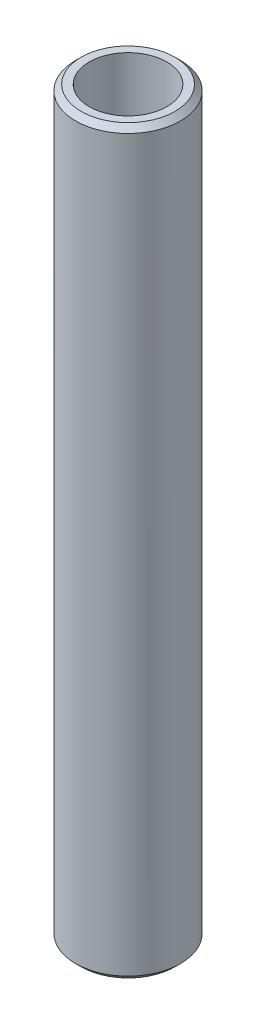
ISO-10303-21;
HEADER;
FILE_DESCRIPTION(('STEP AP214'),'2;1');
FILE_NAME('part.step','',(''),(''),'','','');
FILE_SCHEMA(('AUTOMOTIVE_DESIGN { 1 0 10303 214 1 1 1 1 }'));
ENDSEC;
DATA;
#1=APPLICATION_CONTEXT('core data for automotive mechanical design processes');
#2=APPLICATION_PROTOCOL_DEFINITION('international standard','automotive_design',2000,#1);
#3=PRODUCT_CONTEXT('',#1,'mechanical');
#4=PRODUCT('Part','Part','',(#3));
#5=PRODUCT_RELATED_PRODUCT_CATEGORY('part','',(#4));
#6=PRODUCT_DEFINITION_FORMATION('','',#4);
#7=PRODUCT_DEFINITION_CONTEXT('part definition',#1,'design');
#8=PRODUCT_DEFINITION('design','',#6,#7);
#9=PRODUCT_DEFINITION_SHAPE('','',#8);
#10=(LENGTH_UNIT() NAMED_UNIT(*) SI_UNIT(.MILLI.,.METRE.));
#11=(NAMED_UNIT(*) PLANE_ANGLE_UNIT() SI_UNIT($,.RADIAN.));
#12=(NAMED_UNIT(*) SI_UNIT($,.STERADIAN.) SOLID_ANGLE_UNIT());
#13=UNCERTAINTY_MEASURE_WITH_UNIT(LENGTH_MEASURE(1.E-05),#10,'distance_accuracy_value','');
#14=(GEOMETRIC_REPRESENTATION_CONTEXT(3) GLOBAL_UNCERTAINTY_ASSIGNED_CONTEXT((#13)) GLOBAL_UNIT_ASSIGNED_CONTEXT((#10,
#11,#12)) REPRESENTATION_CONTEXT('',''));
#15=CARTESIAN_POINT('',(0.,0.,0.));
#16=DIRECTION('',(0.,0.,1.));
#17=DIRECTION('',(1.,0.,0.));
#18=AXIS2_PLACEMENT_3D('',#15,#16,#17);
#19=CARTESIAN_POINT('',(0.,600.,0.));
#20=DIRECTION('',(0.,-1.,0.));
#21=DIRECTION('',(0.,0.,-1.));
#22=AXIS2_PLACEMENT_3D('',#19,#20,#21);
#23=CYLINDRICAL_SURFACE('',#22,42.5);
#24=CARTESIAN_POINT('',(0.,595.531423613547,0.));
#25=DIRECTION('',(0.,1.,0.));
#26=DIRECTION('',(0.,0.,1.));
#27=AXIS2_PLACEMENT_3D('',#24,#25,#26);
#28=CIRCLE('',#27,42.5);
#29=CARTESIAN_POINT('',(0.,595.531423613547,-42.5000000000001));
#30=VERTEX_POINT('',#29);
#31=EDGE_CURVE('E50',#30,#30,#28,.F.);
#32=ORIENTED_EDGE('',*,*,#31,.T.);
#33=EDGE_LOOP('',(#32));
#34=FACE_BOUND('',#33,.T.);
#35=CARTESIAN_POINT('',(0.,4.46857638645315,0.));
#36=DIRECTION('',(0.,1.,0.));
#37=DIRECTION('',(0.,0.,1.));
#38=AXIS2_PLACEMENT_3D('',#35,#36,#37);
#39=CIRCLE('',#38,42.5);
#40=CARTESIAN_POINT('',(0.,4.46857638645315,42.5));
#41=VERTEX_POINT('',#40);
#42=EDGE_CURVE('E51',#41,#41,#39,.T.);
#43=ORIENTED_EDGE('',*,*,#42,.T.);
#44=EDGE_LOOP('',(#43));
#45=FACE_BOUND('',#44,.T.);
#46=ADVANCED_FACE('F39',(#34,#45),#23,.T.);
#47=CARTESIAN_POINT('',(0.,600.,0.));
#48=DIRECTION('',(0.,1.,0.));
#49=DIRECTION('',(0.,0.,1.));
#50=AXIS2_PLACEMENT_3D('',#47,#48,#49);
#51=PLANE('',#50);
#52=CARTESIAN_POINT('',(0.,600.,0.));
#53=DIRECTION('',(0.,1.,0.));
#54=DIRECTION('',(0.,0.,1.));
#55=AXIS2_PLACEMENT_3D('',#52,#53,#54);
#56=CIRCLE('',#55,38.0314236135467);
#57=CARTESIAN_POINT('',(0.,600.,-38.0314236135468));
#58=VERTEX_POINT('',#57);
#59=EDGE_CURVE('E54',#58,#58,#56,.T.);
#60=ORIENTED_EDGE('',*,*,#59,.T.);
#61=EDGE_LOOP('',(#60));
#62=FACE_BOUND('',#61,.T.);
#63=CARTESIAN_POINT('',(0.,600.,0.));
#64=DIRECTION('',(0.,1.,0.));
#65=DIRECTION('',(0.,0.,1.));
#66=AXIS2_PLACEMENT_3D('',#63,#64,#65);
#67=CIRCLE('',#66,31.4377701982758);
#68=CARTESIAN_POINT('',(0.,600.,31.4377701982758));
#69=VERTEX_POINT('',#68);
#70=EDGE_CURVE('E58',#69,#69,#67,.T.);
#71=ORIENTED_EDGE('',*,*,#70,.F.);
#72=EDGE_LOOP('',(#71));
#73=FACE_BOUND('',#72,.T.);
#74=ADVANCED_FACE('F69',(#62,#73),#51,.T.);
#75=CARTESIAN_POINT('',(0.,0.,0.));
#76=DIRECTION('',(0.,1.,0.));
#77=DIRECTION('',(0.,0.,1.));
#78=AXIS2_PLACEMENT_3D('',#75,#76,#77);
#79=PLANE('',#78);
#80=CARTESIAN_POINT('',(0.,0.,0.));
#81=DIRECTION('',(0.,1.,0.));
#82=DIRECTION('',(0.,0.,1.));
#83=AXIS2_PLACEMENT_3D('',#80,#81,#82);
#84=CIRCLE('',#83,38.0314236135469);
#85=CARTESIAN_POINT('',(0.,0.,38.0314236135469));
#86=VERTEX_POINT('',#85);
#87=EDGE_CURVE('E10',#86,#86,#84,.F.);
#88=ORIENTED_EDGE('',*,*,#87,.T.);
#89=EDGE_LOOP('',(#88));
#90=FACE_BOUND('',#89,.T.);
#91=CARTESIAN_POINT('',(0.,0.,0.));
#92=DIRECTION('',(0.,1.,0.));
#93=DIRECTION('',(0.,0.,1.));
#94=AXIS2_PLACEMENT_3D('',#91,#92,#93);
#95=CIRCLE('',#94,31.4377701982758);
#96=CARTESIAN_POINT('',(0.,0.,31.4377701982758));
#97=VERTEX_POINT('',#96);
#98=EDGE_CURVE('E63',#97,#97,#95,.T.);
#99=ORIENTED_EDGE('',*,*,#98,.T.);
#100=EDGE_LOOP('',(#99));
#101=FACE_BOUND('',#100,.T.);
#102=ADVANCED_FACE('F75',(#90,#101),#79,.F.);
#103=CARTESIAN_POINT('',(0.,600.,0.));
#104=DIRECTION('',(0.,-1.,0.));
#105=DIRECTION('',(0.,0.,-1.));
#106=AXIS2_PLACEMENT_3D('',#103,#104,#105);
#107=CYLINDRICAL_SURFACE('',#106,31.4377701982758);
#108=ORIENTED_EDGE('',*,*,#70,.T.);
#109=EDGE_LOOP('',(#108));
#110=FACE_BOUND('',#109,.T.);
#111=ORIENTED_EDGE('',*,*,#98,.F.);
#112=EDGE_LOOP('',(#111));
#113=FACE_BOUND('',#112,.T.);
#114=ADVANCED_FACE('F70',(#110,#113),#107,.F.);
#115=CARTESIAN_POINT('',(0.,600.,0.));
#116=DIRECTION('',(0.,-1.,0.));
#117=DIRECTION('',(0.,0.,-1.));
#118=AXIS2_PLACEMENT_3D('',#115,#116,#117);
#119=CONICAL_SURFACE('',#118,38.0314236135467,0.785398163397439);
#120=CARTESIAN_POINT('',(0.,595.531423613547,-42.5000000000001));
#121=CARTESIAN_POINT('',(0.,595.577971284239,-42.4534523293078));
#122=CARTESIAN_POINT('',(0.,595.624518954931,-42.4069046586156));
#123=CARTESIAN_POINT('',(0.,595.717614296315,-42.3138093172312));
#124=CARTESIAN_POINT('',(0.,595.764161967008,-42.267261646539));
#125=CARTESIAN_POINT('',(0.,595.857257308392,-42.1741663051545));
#126=CARTESIAN_POINT('',(0.,595.903804979084,-42.1276186344623));
#127=CARTESIAN_POINT('',(0.,595.996900320469,-42.0345232930779));
#128=CARTESIAN_POINT('',(0.,596.043447991161,-41.9879756223856));
#129=CARTESIAN_POINT('',(0.,596.136543332546,-41.8948802810012));
#130=CARTESIAN_POINT('',(0.,596.183091003238,-41.848332610309));
#131=CARTESIAN_POINT('',(0.,596.276186344622,-41.7552372689245));
#132=CARTESIAN_POINT('',(0.,596.322734015314,-41.7086895982323));
#133=CARTESIAN_POINT('',(0.,596.415829356699,-41.6155942568479));
#134=CARTESIAN_POINT('',(0.,596.462377027391,-41.5690465861556));
#135=CARTESIAN_POINT('',(0.,596.555472368775,-41.4759512447712));
#136=CARTESIAN_POINT('',(0.,596.602020039468,-41.429403574079));
#137=CARTESIAN_POINT('',(0.,596.695115380852,-41.3363082326945));
#138=CARTESIAN_POINT('',(0.,596.741663051544,-41.2897605620023));
#139=CARTESIAN_POINT('',(0.,596.834758392929,-41.1966652206178));
#140=CARTESIAN_POINT('',(0.,596.881306063621,-41.1501175499256));
#141=CARTESIAN_POINT('',(0.,596.974401405005,-41.0570222085412));
#142=CARTESIAN_POINT('',(0.,597.020949075698,-41.010474537849));
#143=CARTESIAN_POINT('',(0.,597.114044417082,-40.9173791964645));
#144=CARTESIAN_POINT('',(0.,597.160592087774,-40.8708315257723));
#145=CARTESIAN_POINT('',(0.,597.253687429159,-40.7777361843879));
#146=CARTESIAN_POINT('',(0.,597.300235099851,-40.7311885136956));
#147=CARTESIAN_POINT('',(0.,597.393330441235,-40.6380931723112));
#148=CARTESIAN_POINT('',(0.,597.439878111928,-40.591545501619));
#149=CARTESIAN_POINT('',(0.,597.532973453312,-40.4984501602345));
#150=CARTESIAN_POINT('',(0.,597.579521124004,-40.4519024895423));
#151=CARTESIAN_POINT('',(0.,597.672616465389,-40.3588071481579));
#152=CARTESIAN_POINT('',(0.,597.719164136081,-40.3122594774657));
#153=CARTESIAN_POINT('',(0.,597.812259477466,-40.2191641360812));
#154=CARTESIAN_POINT('',(0.,597.858807148158,-40.172616465389));
#155=CARTESIAN_POINT('',(0.,597.951902489542,-40.0795211240045));
#156=CARTESIAN_POINT('',(0.,597.998450160234,-40.0329734533123));
#157=CARTESIAN_POINT('',(0.,598.091545501619,-39.9398781119279));
#158=CARTESIAN_POINT('',(0.,598.138093172311,-39.8933304412356));
#159=CARTESIAN_POINT('',(0.,598.231188513696,-39.8002350998512));
#160=CARTESIAN_POINT('',(0.,598.277736184388,-39.753687429159));
#161=CARTESIAN_POINT('',(0.,598.370831525772,-39.6605920877745));
#162=CARTESIAN_POINT('',(0.,598.417379196464,-39.6140444170823));
#163=CARTESIAN_POINT('',(0.,598.510474537849,-39.5209490756979));
#164=CARTESIAN_POINT('',(0.,598.557022208541,-39.4744014050056));
#165=CARTESIAN_POINT('',(0.,598.650117549925,-39.3813060636212));
#166=CARTESIAN_POINT('',(0.,598.696665220618,-39.334758392929));
#167=CARTESIAN_POINT('',(0.,598.789760562002,-39.2416630515445));
#168=CARTESIAN_POINT('',(0.,598.836308232694,-39.1951153808523));
#169=CARTESIAN_POINT('',(0.,598.929403574079,-39.1020200394679));
#170=CARTESIAN_POINT('',(0.,598.975951244771,-39.0554723687756));
#171=CARTESIAN_POINT('',(0.,599.069046586155,-38.9623770273912));
#172=CARTESIAN_POINT('',(0.,599.115594256848,-38.915829356699));
#173=CARTESIAN_POINT('',(0.,599.208689598232,-38.8227340153146));
#174=CARTESIAN_POINT('',(0.,599.255237268924,-38.7761863446223));
#175=CARTESIAN_POINT('',(0.,599.348332610309,-38.6830910032379));
#176=CARTESIAN_POINT('',(0.,599.394880281001,-38.6365433325457));
#177=CARTESIAN_POINT('',(0.,599.487975622386,-38.5434479911612));
#178=CARTESIAN_POINT('',(0.,599.534523293078,-38.496900320469));
#179=CARTESIAN_POINT('',(0.,599.627618634462,-38.4038049790845));
#180=CARTESIAN_POINT('',(0.,599.674166305154,-38.3572573083923));
#181=CARTESIAN_POINT('',(0.,599.767261646539,-38.2641619670079));
#182=CARTESIAN_POINT('',(0.,599.813809317231,-38.2176142963157));
#183=CARTESIAN_POINT('',(0.,599.906904658616,-38.1245189549312));
#184=CARTESIAN_POINT('',(0.,599.953452329308,-38.077971284239));
#185=CARTESIAN_POINT('',(0.,600.,-38.0314236135468));
#186=B_SPLINE_CURVE_WITH_KNOTS('',3,(#120,#121,#122,#123,#124,#125,#126,#127,#128,#129,#130,
#131,#132,#133,#134,#135,#136,#137,#138,#139,#140,#141,#142,#143,#144,#145,#146,#147,#148,#149,
#150,#151,#152,#153,#154,#155,#156,#157,#158,#159,#160,#161,#162,#163,#164,#165,#166,#167,#168,
#169,#170,#171,#172,#173,#174,#175,#176,#177,#178,#179,#180,#181,#182,#183,#184,#185),
.UNSPECIFIED.,.F.,.F.,(4,2,2,2,2,2,2,2,2,2,2,2,2,2,2,2,2,2,2,2,2,2,2,2,2,2,2,2,2,2,2,2,4),(0.,
0.197485041569395,0.394970083138863,0.592455124708336,0.789940166277805,0.987425207847199,
1.18491024941667,1.38239529098614,1.57988033255561,1.77736537412501,1.97485041569448,
2.17233545726395,2.36982049883342,2.56730554040281,2.76479058197229,2.96227562354175,
3.15976066511123,3.35724570668062,3.55473074825009,3.75221578981956,3.94970083138903,
4.14718587295843,4.3446709145279,4.54215595609737,4.73964099766684,4.93712603923624,
5.1346110808057,5.33209612237518,5.52958116394465,5.72706620551404,5.92455124708351,
6.12203628865298,6.31952133022246),.UNSPECIFIED.);
#187=EDGE_CURVE('BSEAM81',#30,#58,#186,.T.);
#188=ORIENTED_EDGE('',*,*,#31,.F.);
#189=ORIENTED_EDGE('',*,*,#59,.F.);
#190=ORIENTED_EDGE('',*,*,#187,.T.);
#191=ORIENTED_EDGE('',*,*,#187,.F.);
#192=EDGE_LOOP('',(#188,#190,#189,#191));
#193=FACE_BOUND('',#192,.T.);
#194=ADVANCED_FACE('F81',(#193),#119,.T.);
#195=CARTESIAN_POINT('',(0.,4.46857638645315,0.));
#196=DIRECTION('',(0.,1.,0.));
#197=DIRECTION('',(0.,0.,1.));
#198=AXIS2_PLACEMENT_3D('',#195,#196,#197);
#199=CONICAL_SURFACE('',#198,42.5,0.785398163397445);
#200=ORIENTED_EDGE('',*,*,#87,.F.);
#201=EDGE_LOOP('',(#200));
#202=FACE_BOUND('',#201,.T.);
#203=ORIENTED_EDGE('',*,*,#42,.F.);
#204=EDGE_LOOP('',(#203));
#205=FACE_BOUND('',#204,.T.);
#206=ADVANCED_FACE('F45',(#202,#205),#199,.T.);
#207=CLOSED_SHELL('',(#46,#74,#102,#114,#194,#206));
#208=MANIFOLD_SOLID_BREP('B2',#207);
#209=ADVANCED_BREP_SHAPE_REPRESENTATION('',(#18,#208),#14);
#210=SHAPE_DEFINITION_REPRESENTATION(#9,#209);
ENDSEC;
END-ISO-10303-21;
